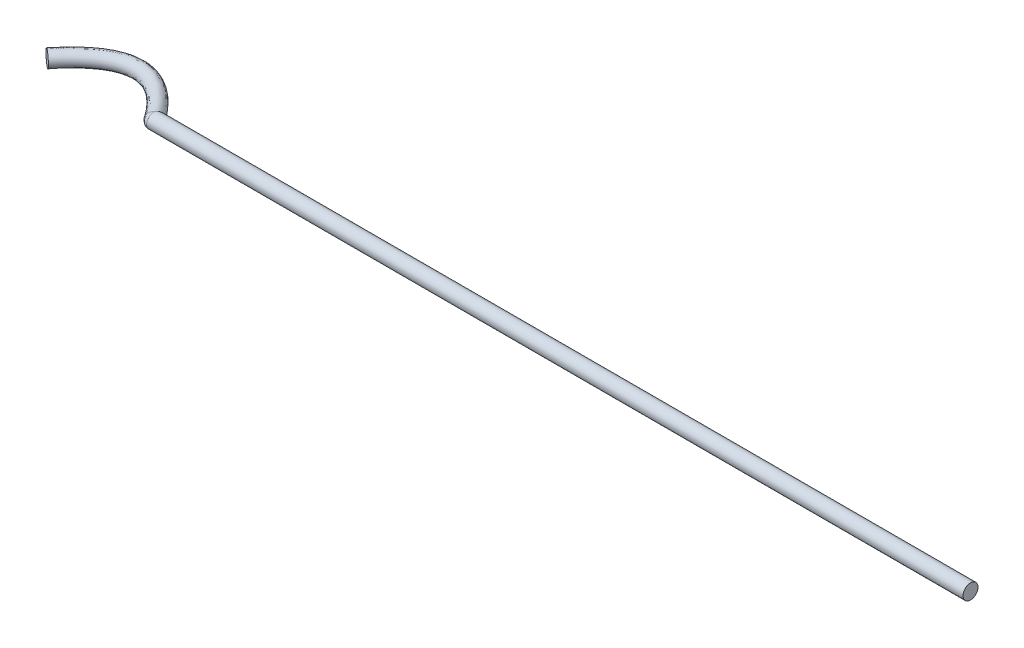
ISO-10303-21;
HEADER;
FILE_DESCRIPTION(('STEP AP214'),'2;1');
FILE_NAME('part.step','',(''),(''),'','','');
FILE_SCHEMA(('AUTOMOTIVE_DESIGN { 1 0 10303 214 1 1 1 1 }'));
ENDSEC;
DATA;
#1=APPLICATION_CONTEXT('core data for automotive mechanical design processes');
#2=APPLICATION_PROTOCOL_DEFINITION('international standard','automotive_design',2000,#1);
#3=PRODUCT_CONTEXT('',#1,'mechanical');
#4=PRODUCT('Part','Part','',(#3));
#5=PRODUCT_RELATED_PRODUCT_CATEGORY('part','',(#4));
#6=PRODUCT_DEFINITION_FORMATION('','',#4);
#7=PRODUCT_DEFINITION_CONTEXT('part definition',#1,'design');
#8=PRODUCT_DEFINITION('design','',#6,#7);
#9=PRODUCT_DEFINITION_SHAPE('','',#8);
#10=(LENGTH_UNIT() NAMED_UNIT(*) SI_UNIT(.MILLI.,.METRE.));
#11=(NAMED_UNIT(*) PLANE_ANGLE_UNIT() SI_UNIT($,.RADIAN.));
#12=(NAMED_UNIT(*) SI_UNIT($,.STERADIAN.) SOLID_ANGLE_UNIT());
#13=UNCERTAINTY_MEASURE_WITH_UNIT(LENGTH_MEASURE(1.E-05),#10,'distance_accuracy_value','');
#14=(GEOMETRIC_REPRESENTATION_CONTEXT(3) GLOBAL_UNCERTAINTY_ASSIGNED_CONTEXT((#13)) GLOBAL_UNIT_ASSIGNED_CONTEXT((#10,
#11,#12)) REPRESENTATION_CONTEXT('',''));
#15=CARTESIAN_POINT('',(0.,0.,0.));
#16=DIRECTION('',(0.,0.,1.));
#17=DIRECTION('',(1.,0.,0.));
#18=AXIS2_PLACEMENT_3D('',#15,#16,#17);
#19=CARTESIAN_POINT('',(142.755413202627,0.,1.05970796374089E-08));
#20=DIRECTION('',(1.,0.,0.));
#21=DIRECTION('',(0.,0.,-1.));
#22=AXIS2_PLACEMENT_3D('',#19,#20,#21);
#23=PLANE('',#22);
#24=CARTESIAN_POINT('',(142.755413202627,0.,1.05970796374089E-08));
#25=DIRECTION('',(1.,0.,0.));
#26=DIRECTION('',(0.,0.,-1.));
#27=AXIS2_PLACEMENT_3D('',#24,#25,#26);
#28=CIRCLE('',#27,1.);
#29=CARTESIAN_POINT('',(142.755413202627,0.,-0.99999998940292));
#30=VERTEX_POINT('',#29);
#31=EDGE_CURVE('E74',#30,#30,#28,.T.);
#32=ORIENTED_EDGE('',*,*,#31,.T.);
#33=EDGE_LOOP('',(#32));
#34=FACE_BOUND('',#33,.T.);
#35=ADVANCED_FACE('F35',(#34),#23,.T.);
#36=CARTESIAN_POINT('',(19.2045723780013,0.,0.));
#37=DIRECTION('',(0.623586463221528,0.,-0.781754387827063));
#38=DIRECTION('',(-0.781754387827063,0.,-0.623586463221528));
#39=AXIS2_PLACEMENT_3D('',#36,#37,#38);
#40=PLANE('',#39);
#41=CARTESIAN_POINT('',(19.2045723780013,0.,0.));
#42=DIRECTION('',(0.623586463221528,0.,-0.781754387827063));
#43=DIRECTION('',(-0.781754387827063,0.,-0.623586463221528));
#44=AXIS2_PLACEMENT_3D('',#41,#42,#43);
#45=CIRCLE('',#44,1.);
#46=CARTESIAN_POINT('',(18.4228179901742,0.,-0.623586463221501));
#47=VERTEX_POINT('',#46);
#48=EDGE_CURVE('E64',#47,#47,#45,.T.);
#49=ORIENTED_EDGE('',*,*,#48,.F.);
#50=EDGE_LOOP('',(#49));
#51=FACE_BOUND('',#50,.T.);
#52=ADVANCED_FACE('F96',(#51),#40,.F.);
#53=CARTESIAN_POINT('',(32.8922100901938,0.,1.05970796374089E-08));
#54=DIRECTION('',(1.,0.,0.));
#55=DIRECTION('',(0.,0.,-1.));
#56=AXIS2_PLACEMENT_3D('',#53,#54,#55);
#57=CYLINDRICAL_SURFACE('',#56,1.);
#58=CARTESIAN_POINT('',(33.5634876384177,-1.,1.05970794849486E-08));
#59=CARTESIAN_POINT('',(33.5645618571712,-1.00000001707824,-0.00206843211272683));
#60=CARTESIAN_POINT('',(33.565636073607,-0.999993598383162,-0.00413704757754758));
#61=CARTESIAN_POINT('',(33.5986736436733,-0.999598246638996,-0.0677628444332316));
#62=CARTESIAN_POINT('',(33.6306179253825,-0.993517402724324,-0.129439853689024));
#63=CARTESIAN_POINT('',(33.6935439684631,-0.969918293114115,-0.251244158086531));
#64=CARTESIAN_POINT('',(33.7245227170214,-0.952367378941007,-0.311366518689833));
#65=CARTESIAN_POINT('',(33.7846063846737,-0.905844840684269,-0.42825995213969));
#66=CARTESIAN_POINT('',(33.8137072235116,-0.876849261828727,-0.485023706680189));
#67=CARTESIAN_POINT('',(33.8689192108485,-0.807771463073951,-0.592961904271321));
#68=CARTESIAN_POINT('',(33.8950332772621,-0.767700196604047,-0.644141800156));
#69=CARTESIAN_POINT('',(33.941448845235,-0.680472351006147,-0.73528507147826));
#70=CARTESIAN_POINT('',(33.9620340567545,-0.634037297478791,-0.775791807949197));
#71=CARTESIAN_POINT('',(33.998765685496,-0.533325377361822,-0.84817381113771));
#72=CARTESIAN_POINT('',(34.0149157564868,-0.479055022253214,-0.880056182475265));
#73=CARTESIAN_POINT('',(34.0403248121784,-0.37111475846728,-0.930265600920773));
#74=CARTESIAN_POINT('',(34.0501686729454,-0.3181163286775,-0.949741590321047));
#75=CARTESIAN_POINT('',(34.065227329107,-0.208987567106348,-0.979548800169467));
#76=CARTESIAN_POINT('',(34.0704454651527,-0.152859526686506,-0.989886620094845));
#77=CARTESIAN_POINT('',(34.0757201076478,-0.0447205214606043,-1.00033682367351));
#78=CARTESIAN_POINT('',(34.0762114786276,0.00718793330168519,-1.0013106910395));
#79=CARTESIAN_POINT('',(34.0731422322687,0.110403508472085,-0.995229358400241));
#80=CARTESIAN_POINT('',(34.0695824983274,0.161710757516657,-0.988175908858395));
#81=CARTESIAN_POINT('',(34.0587213809389,0.260878590586203,-0.966669333665237));
#82=CARTESIAN_POINT('',(34.0515218512398,0.308794517637005,-0.952417648703762));
#83=CARTESIAN_POINT('',(34.0337299049864,0.401426725887555,-0.917230902854717));
#84=CARTESIAN_POINT('',(34.0231369694115,0.44614251634633,-0.896294819591532));
#85=CARTESIAN_POINT('',(33.9984186127761,0.533237999151212,-0.847499369345232));
#86=CARTESIAN_POINT('',(33.9841607762834,0.575434312322461,-0.819380807001654));
#87=CARTESIAN_POINT('',(33.9528573500051,0.654483346586658,-0.757737605279711));
#88=CARTESIAN_POINT('',(33.9358112598222,0.691335106269149,-0.724211995534314));
#89=CARTESIAN_POINT('',(33.8977655023653,0.762249045884659,-0.649510320244149));
#90=CARTESIAN_POINT('',(33.8765472382783,0.795752427981589,-0.607915725242693));
#91=CARTESIAN_POINT('',(33.8319768566358,0.855364302023736,-0.520717743084864));
#92=CARTESIAN_POINT('',(33.8086222681337,0.881464083951692,-0.475109716230344));
#93=CARTESIAN_POINT('',(33.7553267883935,0.930659629166448,-0.371250222256335));
#94=CARTESIAN_POINT('',(33.7250280501394,0.951993907192843,-0.312345525250553));
#95=CARTESIAN_POINT('',(33.6631511402496,0.983275848501732,-0.192363271745083));
#96=CARTESIAN_POINT('',(33.6315753798832,0.993244020993211,-0.131289834628256));
#97=CARTESIAN_POINT('',(33.5887965811424,0.999038227252166,-0.0487594090821208));
#98=CARTESIAN_POINT('',(33.5777581085035,0.999848761517422,-0.0274823865216696));
#99=CARTESIAN_POINT('',(33.5656361429811,0.999993575747745,-0.00413718371064076));
#100=CARTESIAN_POINT('',(33.5645619289377,0.999999993574401,-0.00206857299587797));
#101=CARTESIAN_POINT('',(33.5634876384177,1.,1.05970794849486E-08));
#102=B_SPLINE_CURVE_WITH_KNOTS('',3,(#58,#59,#60,#61,#62,#63,#64,#65,#66,#67,#68,#69,#70,#71,
#72,#73,#74,#75,#76,#77,#78,#79,#80,#81,#82,#83,#84,#85,#86,#87,#88,#89,#90,#91,#92,#93,#94,#95,
#96,#97,#98,#99,#100,#101),.UNSPECIFIED.,.F.,.F.,(4,2,2,2,2,2,2,2,2,2,2,2,2,2,2,2,2,2,2,2,2,4),
(0.,0.0069926949216396,0.215064933442348,0.423732024814681,0.632838212303739,0.841738337208042,
1.03553833475279,1.22917819324666,1.40018101455756,1.57106023853186,1.72604913651374,
1.88100424357622,2.03184514714453,2.18270913282006,2.34006630740664,2.49745175333244,
2.66915557307549,2.84106056504955,3.04881432184063,3.25619260774662,3.32811546508498,
3.33510816000663),.UNSPECIFIED.);
#103=CARTESIAN_POINT('',(33.5634876384177,-1.,1.05970794849486E-08));
#104=VERTEX_POINT('',#103);
#105=CARTESIAN_POINT('',(33.5634876384177,1.,1.05970794849486E-08));
#106=VERTEX_POINT('',#105);
#107=EDGE_CURVE('E60',#104,#106,#102,.T.);
#108=ORIENTED_EDGE('',*,*,#107,.T.);
#109=CARTESIAN_POINT('',(33.5634876384163,1.,1.0599347923879E-08));
#110=CARTESIAN_POINT('',(33.563487638417,1.,1.05982130183477E-08));
#111=CARTESIAN_POINT('',(33.5634876384177,1.,1.05970781128164E-08));
#112=CARTESIAN_POINT('',(33.5583326452643,1.00000017527205,0.00403970542274364));
#113=CARTESIAN_POINT('',(33.560740318687,0.999999720157798,0.00529006858815662));
#114=CARTESIAN_POINT('',(33.5631479681356,1.00000017527251,0.00654047791995372));
#115=CARTESIAN_POINT('',(33.5531766296348,0.99993597797552,0.0080802009670581));
#116=CARTESIAN_POINT('',(33.5579923657262,0.999960141903188,0.0105813454637634));
#117=CARTESIAN_POINT('',(33.5628082304812,0.999935977975861,0.013082242217189));
#118=CARTESIAN_POINT('',(33.4993852061216,0.998594878029329,0.050233676407915));
#119=CARTESIAN_POINT('',(33.5293115482904,0.999134732013883,0.0658072304092581));
#120=CARTESIAN_POINT('',(33.559263832375,0.998594878015358,0.081330832347194));
#121=CARTESIAN_POINT('',(33.4507398682004,0.991656715418915,0.0883543908193207));
#122=CARTESIAN_POINT('',(33.5032634472072,0.994863916455852,0.115963693521937));
#123=CARTESIAN_POINT('',(33.5560585176457,0.991656715279997,0.143050230171953));
#124=CARTESIAN_POINT('',(33.3549044405813,0.966349053285513,0.163455331235492));
#125=CARTESIAN_POINT('',(33.4509845621792,0.978792201549973,0.216628310077008));
#126=CARTESIAN_POINT('',(33.5497437767522,0.966349051510766,0.264642609212375));
#127=CARTESIAN_POINT('',(33.3077159688607,0.947967292345187,0.200434289223319));
#128=CARTESIAN_POINT('',(33.4246299612976,0.96690517465437,0.267374876418478));
#129=CARTESIAN_POINT('',(33.5466344571989,0.947967289058071,0.324513537542976));
#130=CARTESIAN_POINT('',(33.2160309999586,0.899797374814006,0.27228257735366));
#131=CARTESIAN_POINT('',(33.3715529191412,0.934090796110148,0.36957623222255));
#132=CARTESIAN_POINT('',(33.5405931964196,0.899797366294538,0.440839873670975));
#133=CARTESIAN_POINT('',(33.171545929159,0.86996424103204,0.307142952970489));
#134=CARTESIAN_POINT('',(33.3447196103025,0.912972199576392,0.42124449944437));
#135=CARTESIAN_POINT('',(33.5376620080955,0.869964228783853,0.497280783928699));
#136=CARTESIAN_POINT('',(33.0871996900747,0.799325708638596,0.373240155932504));
#137=CARTESIAN_POINT('',(33.2912469455894,0.859442040816378,0.524207517513955));
#138=CARTESIAN_POINT('',(33.5321043075086,0.799325688022374,0.604295938659696));
#139=CARTESIAN_POINT('',(33.0473250756087,0.758553430928407,0.404487520461767));
#140=CARTESIAN_POINT('',(33.2645320813386,0.826834234105904,0.575647661144126));
#141=CARTESIAN_POINT('',(33.5294769092562,0.758553405675631,0.654887243238981));
#142=CARTESIAN_POINT('',(32.9764234718248,0.670002895720354,0.460048847878707));
#143=CARTESIAN_POINT('',(33.2142707604962,0.750456866455089,0.67242706034935));
#144=CARTESIAN_POINT('',(33.5248050962309,0.670002862610851,0.744844312985016));
#145=CARTESIAN_POINT('',(32.9449697215301,0.622925942306552,0.484697241078829));
#146=CARTESIAN_POINT('',(33.1906061650005,0.707390618848897,0.71799379757729));
#147=CARTESIAN_POINT('',(33.5227325615244,0.622925905899787,0.784751537345482));
#148=CARTESIAN_POINT('',(32.8889685710638,0.521005661914969,0.528581915747774));
#149=CARTESIAN_POINT('',(33.146218792874,0.607508424356457,0.803462707246637));
#150=CARTESIAN_POINT('',(33.5190425620126,0.521005622180927,0.855803475640208));
#151=CARTESIAN_POINT('',(32.8644140336748,0.466170449817818,0.547823790246045));
#152=CARTESIAN_POINT('',(33.125565343926,0.550571809202559,0.843231387299727));
#153=CARTESIAN_POINT('',(33.5174246269254,0.466170410050373,0.886957245000646));
#154=CARTESIAN_POINT('',(32.8267166958155,0.35926388010532,0.577364854908452));
#155=CARTESIAN_POINT('',(33.0925201777565,0.433144480352106,0.906860586850707));
#156=CARTESIAN_POINT('',(33.5149406931933,0.359263844074003,0.934786041458632));
#157=CARTESIAN_POINT('',(32.8124095851906,0.308028959647363,0.58857644468085));
#158=CARTESIAN_POINT('',(33.0794161042199,0.374451132341706,0.932092765935491));
#159=CARTESIAN_POINT('',(33.5139979764042,0.308028926811141,0.952938297772015));
#160=CARTESIAN_POINT('',(32.7904912534921,0.202715571262597,0.605752470522789));
#161=CARTESIAN_POINT('',(33.0588714338136,0.249739310019017,0.971651973543824));
#162=CARTESIAN_POINT('',(33.5125537449709,0.202715547579491,0.980747346915997));
#163=CARTESIAN_POINT('',(32.7828752923419,0.148639145114601,0.611720621096671));
#164=CARTESIAN_POINT('',(33.051508470796,0.183923070803632,0.985829516381074));
#165=CARTESIAN_POINT('',(33.512051917996,0.148639127387555,0.99041015375681));
#166=CARTESIAN_POINT('',(32.7750412394666,0.0434317615714261,0.6178596763614));
#167=CARTESIAN_POINT('',(33.0438864151151,0.0540540284430793,1.00050594759188));
#168=CARTESIAN_POINT('',(33.5115357206342,0.0434317562272698,1.00034966601376));
#169=CARTESIAN_POINT('',(32.7743208280073,-0.00762377671425389,0.61842421749655));
#170=CARTESIAN_POINT('',(33.0431763661558,-0.00952452543752111,1.00187316196964));
#171=CARTESIAN_POINT('',(33.5114882516551,-0.00762377569829967,1.0012636933));
#172=CARTESIAN_POINT('',(32.7790022139256,-0.109154089371847,0.614755709440504));
#173=CARTESIAN_POINT('',(33.0477477238517,-0.135377011758896,0.993070915063814));
#174=CARTESIAN_POINT('',(33.5117967151153,-0.109154076175719,0.995324150531231));
#175=CARTESIAN_POINT('',(32.7844034525975,-0.159628916318967,0.610523098071874));
#176=CARTESIAN_POINT('',(33.0530094854984,-0.197390129558612,0.982939280663443));
#177=CARTESIAN_POINT('',(33.5121526107408,-0.159628897302725,0.988471289338209));
#178=CARTESIAN_POINT('',(32.8010538496347,-0.258436826311597,0.597475224848372));
#179=CARTESIAN_POINT('',(33.0688390537305,-0.316265521842121,0.952459105955179));
#180=CARTESIAN_POINT('',(33.5132497301191,-0.258436797575616,0.96734597341924));
#181=CARTESIAN_POINT('',(32.8122902514871,-0.306774332714654,0.58866995947828));
#182=CARTESIAN_POINT('',(33.0793374052037,-0.372949077040057,0.932244302977881));
#183=CARTESIAN_POINT('',(33.5139901133264,-0.306774300074893,0.953089703618175));
#184=CARTESIAN_POINT('',(32.8401277329115,-0.4002487267014,0.566855458293986));
#185=CARTESIAN_POINT('',(33.1044333567383,-0.478896267597812,0.883921497784031));
#186=CARTESIAN_POINT('',(33.5158243663888,-0.400248688783991,0.917770682558624));
#187=CARTESIAN_POINT('',(32.8567372172254,-0.445380463942184,0.553839636196544));
#188=CARTESIAN_POINT('',(33.1189686566204,-0.528069854447588,0.855933455972328));
#189=CARTESIAN_POINT('',(33.5169187900449,-0.445380424654893,0.896697267710754));
#190=CARTESIAN_POINT('',(32.8952291840759,-0.532638564415938,0.523675855898953));
#191=CARTESIAN_POINT('',(33.1512218578494,-0.619147824537299,0.79382918974049));
#192=CARTESIAN_POINT('',(33.5194550831631,-0.532638524878462,0.847860269053471));
#193=CARTESIAN_POINT('',(32.9172517883959,-0.574638280040118,0.50641809252461));
#194=CARTESIAN_POINT('',(33.1689679385769,-0.660833019763568,0.759658705072188));
#195=CARTESIAN_POINT('',(33.520906185461,-0.574638241696389,0.81991890430827));
#196=CARTESIAN_POINT('',(32.9655222451827,-0.653384719975428,0.468591475523054));
#197=CARTESIAN_POINT('',(33.2060656831409,-0.735316375295904,0.68822612938919));
#198=CARTESIAN_POINT('',(33.5240867980869,-0.653384685702211,0.758675340005979));
#199=CARTESIAN_POINT('',(32.9917767887296,-0.690122948758282,0.44801737847095));
#200=CARTESIAN_POINT('',(33.2253931104493,-0.768188645346138,0.651010706564431));
#201=CARTESIAN_POINT('',(33.5258167493004,-0.690122917364514,0.725364651059709));
#202=CARTESIAN_POINT('',(33.0810411628006,-0.798003838682993,0.378066240964416));
#203=CARTESIAN_POINT('',(33.2876305479194,-0.859626018852598,0.531170993901763));
#204=CARTESIAN_POINT('',(33.5316985128526,-0.798003817277604,0.612109638635763));
#205=CARTESIAN_POINT('',(33.150682801895,-0.858211460108621,0.32349219509103));
#206=CARTESIAN_POINT('',(33.332262134845,-0.904539644330012,0.445231720233561));
#207=CARTESIAN_POINT('',(33.5362873052242,-0.858211446775006,0.523751109465869));
#208=CARTESIAN_POINT('',(33.3073182572667,-0.952791298080286,0.20074598264367));
#209=CARTESIAN_POINT('',(33.4248893738353,-0.970670157300568,0.266875394418477));
#210=CARTESIAN_POINT('',(33.5466082513368,-0.9527912955414,0.32501815643727));
#211=CARTESIAN_POINT('',(33.3953818854532,-0.983515763116975,0.131735440388595));
#212=CARTESIAN_POINT('',(33.473428815746,-0.989778525205945,0.173411242816727));
#213=CARTESIAN_POINT('',(33.5524108966286,-0.983515762600918,0.213286381671401));
#214=CARTESIAN_POINT('',(33.5054218018745,-0.997653842088145,0.0455031087878745));
#215=CARTESIAN_POINT('',(33.5325203098151,-0.998542262348482,0.0596286443973174));
#216=CARTESIAN_POINT('',(33.5596615927971,-0.997653842083429,0.0736718152746343));
#217=CARTESIAN_POINT('',(33.5267122350289,-0.999277656884468,0.0288189384952626));
#218=CARTESIAN_POINT('',(33.5438841691981,-0.999552309962828,0.0377471554894));
#219=CARTESIAN_POINT('',(33.5610644515743,-0.999277656886274,0.0466592977374858));
#220=CARTESIAN_POINT('',(33.5531752823525,-0.999935587438923,0.00808125676964304));
#221=CARTESIAN_POINT('',(33.5579916052308,-0.999960557789523,0.0105828097995959));
#222=CARTESIAN_POINT('',(33.5628081417099,-0.999935587439514,0.0130839515313309));
#223=CARTESIAN_POINT('',(33.5583311072671,-0.999999720458585,0.0040409106687492));
#224=CARTESIAN_POINT('',(33.5607394481972,-1.0000002306226,0.0052917447262729));
#225=CARTESIAN_POINT('',(33.5631478667967,-0.9999997204585,0.00654242922601521));
#226=CARTESIAN_POINT('',(33.5634876384043,-1.,1.06134015692792E-08));
#227=CARTESIAN_POINT('',(33.563487638411,-1.,1.06052398410427E-08));
#228=CARTESIAN_POINT('',(33.5634876384177,-1.,1.05970781128062E-08));
#229=(BOUNDED_SURFACE() B_SPLINE_SURFACE(3,2,((#109,#110,#111),(#112,#113,#114),(#115,#116,
#117),(#118,#119,#120),(#121,#122,#123),(#124,#125,#126),(#127,#128,#129),(#130,#131,#132),
(#133,#134,#135),(#136,#137,#138),(#139,#140,#141),(#142,#143,#144),(#145,#146,#147),(#148,#149,
#150),(#151,#152,#153),(#154,#155,#156),(#157,#158,#159),(#160,#161,#162),(#163,#164,#165),
(#166,#167,#168),(#169,#170,#171),(#172,#173,#174),(#175,#176,#177),(#178,#179,#180),(#181,#182,
#183),(#184,#185,#186),(#187,#188,#189),(#190,#191,#192),(#193,#194,#195),(#196,#197,#198),
(#199,#200,#201),(#202,#203,#204),(#205,#206,#207),(#208,#209,#210),(#211,#212,#213),(#214,#215,
#216),(#217,#218,#219),(#220,#221,#222),(#223,#224,#225),(#226,#227,#228)),.UNSPECIFIED.,.F.,
.F.,.F.) B_SPLINE_SURFACE_WITH_KNOTS((4,2,2,2,2,2,2,2,2,2,2,2,2,2,2,2,2,2,2,4),(3,3),(0.,
0.00221135975834844,0.0230700590877943,0.0439511463442617,0.0649151009450075,0.0858162847372265,
0.105236186574584,0.124635923979986,0.141101410418374,0.157555223115761,0.172800415242591,
0.188044216095807,0.203254831211352,0.218489355232701,0.234169832799107,0.249875350297204,
0.284226312954623,0.322423658930579,0.331564733870084,0.333776093628432),(0.,1.),
.UNSPECIFIED.) GEOMETRIC_REPRESENTATION_ITEM() RATIONAL_B_SPLINE_SURFACE(((1.,1.,1.),(1.,
1.00000015317631,1.),(1.,0.999986494475104,1.),(1.,0.999700671783427,1.),(1.,0.99821989135975,
1.),(1.,0.992933819967693,1.),(1.,0.989126035776246,1.),(1.,0.979521223065697,1.),(1.,
0.97371636012893,1.),(1.,0.960769359275711,1.),(1.,0.953631277505015,1.),(1.,0.939466544444144,
1.),(1.,0.932467848146358,1.),(1.,0.919095987276323,1.),(1.,0.912722180736016,1.),(1.,
0.902500881477163,1.),(1.,0.898417093322185,1.),(1.,0.892038551286664,1.),(1.,0.889742531064951,
1.),(1.,0.887376629262475,1.),(1.,0.887155614498465,1.),(1.,0.88857413394442,1.),(1.,
0.890213498362846,1.),(1.,0.895128493505031,1.),(1.,0.898400554309364,1.),(1.,0.906178221943761,
1.),(1.,0.9106857596469,1.),(1.,0.92057169133087,1.),(1.,0.925971715074011,1.),(1.,
0.936998557045195,1.),(1.,0.942625723667827,1.),(1.,0.960112144719853,1.),(1.,0.971439024375837,
1.),(1.,0.989936590385214,1.),(1.,0.996499878844236,1.),(1.,0.99950396058657,1.),(1.,
0.999846992364841,1.),(1.,0.99998621699724,1.),(1.,0.999999822330879,1.),(1.,1.,1.))) REPRESENTATION_ITEM('') SURFACE());
#230=CARTESIAN_POINT('',(33.5634876384177,1.,1.05970781128164E-08));
#231=CARTESIAN_POINT('',(33.5631479681356,1.00000017527251,0.00654047791995372));
#232=CARTESIAN_POINT('',(33.5628082304812,0.999935977975861,0.013082242217189));
#233=CARTESIAN_POINT('',(33.559263832375,0.998594878015358,0.081330832347194));
#234=CARTESIAN_POINT('',(33.5560585176457,0.991656715279997,0.143050230171953));
#235=CARTESIAN_POINT('',(33.5497437767522,0.966349051510766,0.264642609212375));
#236=CARTESIAN_POINT('',(33.5466344571989,0.947967289058071,0.324513537542976));
#237=CARTESIAN_POINT('',(33.5405931964196,0.899797366294538,0.440839873670975));
#238=CARTESIAN_POINT('',(33.5376620080955,0.869964228783853,0.497280783928699));
#239=CARTESIAN_POINT('',(33.5321043075086,0.799325688022374,0.604295938659696));
#240=CARTESIAN_POINT('',(33.5294769092562,0.758553405675631,0.654887243238981));
#241=CARTESIAN_POINT('',(33.5248050962309,0.670002862610852,0.744844312985016));
#242=CARTESIAN_POINT('',(33.5227325615244,0.622925905899787,0.784751537345482));
#243=CARTESIAN_POINT('',(33.5190425620126,0.521005622180927,0.855803475640208));
#244=CARTESIAN_POINT('',(33.5174246269254,0.466170410050373,0.886957245000646));
#245=CARTESIAN_POINT('',(33.5149406931933,0.359263844074003,0.934786041458632));
#246=CARTESIAN_POINT('',(33.5139979764042,0.308028926811141,0.952938297772015));
#247=CARTESIAN_POINT('',(33.5125537449709,0.202715547579491,0.980747346915997));
#248=CARTESIAN_POINT('',(33.512051917996,0.148639127387555,0.99041015375681));
#249=CARTESIAN_POINT('',(33.5115357206342,0.0434317562272698,1.00034966601376));
#250=CARTESIAN_POINT('',(33.5114882516551,-0.00762377569829962,1.0012636933));
#251=CARTESIAN_POINT('',(33.5117967151153,-0.109154076175719,0.995324150531231));
#252=CARTESIAN_POINT('',(33.5121526107408,-0.159628897302725,0.988471289338209));
#253=CARTESIAN_POINT('',(33.5132497301191,-0.258436797575616,0.96734597341924));
#254=CARTESIAN_POINT('',(33.5139901133264,-0.306774300074893,0.953089703618175));
#255=CARTESIAN_POINT('',(33.5158243663888,-0.400248688783991,0.917770682558624));
#256=CARTESIAN_POINT('',(33.5169187900449,-0.445380424654893,0.896697267710754));
#257=CARTESIAN_POINT('',(33.5194550831631,-0.532638524878462,0.847860269053471));
#258=CARTESIAN_POINT('',(33.520906185461,-0.574638241696389,0.81991890430827));
#259=CARTESIAN_POINT('',(33.5240867980869,-0.653384685702211,0.758675340005979));
#260=CARTESIAN_POINT('',(33.5258167493004,-0.690122917364514,0.72536465105971));
#261=CARTESIAN_POINT('',(33.5316985128526,-0.798003817277604,0.612109638635763));
#262=CARTESIAN_POINT('',(33.5362873052242,-0.858211446775006,0.523751109465869));
#263=CARTESIAN_POINT('',(33.5466082513368,-0.9527912955414,0.32501815643727));
#264=CARTESIAN_POINT('',(33.5524108966286,-0.983515762600918,0.2132863816714));
#265=CARTESIAN_POINT('',(33.5596615927971,-0.997653842083429,0.0736718152746344));
#266=CARTESIAN_POINT('',(33.5610644515743,-0.999277656886274,0.0466592977374858));
#267=CARTESIAN_POINT('',(33.5628081417099,-0.999935587439514,0.0130839515313309));
#268=CARTESIAN_POINT('',(33.5631478667967,-0.9999997204585,0.00654242922601521));
#269=CARTESIAN_POINT('',(33.5634876384177,-1.,1.05970781128062E-08));
#270=B_SPLINE_CURVE_WITH_KNOTS('',3,(#230,#231,#232,#233,#234,#235,#236,#237,#238,#239,#240,
#241,#242,#243,#244,#245,#246,#247,#248,#249,#250,#251,#252,#253,#254,#255,#256,#257,#258,#259,
#260,#261,#262,#263,#264,#265,#266,#267,#268,#269),.UNSPECIFIED.,.F.,.F.,(4,2,2,2,2,2,2,2,2,2,2,
2,2,2,2,2,2,2,2,4),(0.,0.00221135975834844,0.0230700590877943,0.0439511463442617,
0.0649151009450075,0.0858162847372265,0.105236186574584,0.124635923979986,0.141101410418374,
0.157555223115761,0.172800415242591,0.188044216095807,0.203254831211352,0.218489355232701,
0.234169832799107,0.249875350297204,0.284226312954623,0.322423658930579,0.331564733870084,
0.333776093628432),.UNSPECIFIED.);
#271=EDGE_CURVE('E11',#106,#104,#270,.T.);
#272=ORIENTED_EDGE('',*,*,#271,.T.);
#273=EDGE_LOOP('',(#108,#272));
#274=FACE_BOUND('',#273,.T.);
#275=ORIENTED_EDGE('',*,*,#31,.F.);
#276=EDGE_LOOP('',(#275));
#277=FACE_BOUND('',#276,.T.);
#278=ADVANCED_FACE('F58',(#274,#277),#57,.T.);
#279=CARTESIAN_POINT('',(18.4228179901742,0.,-0.623586463221512));
#280=CARTESIAN_POINT('',(19.7424759047375,0.,-2.27796548901796));
#281=CARTESIAN_POINT('',(21.0633845920573,0.,-3.55066802562976));
#282=CARTESIAN_POINT('',(23.7793936991134,0.,-5.30513360359097));
#283=CARTESIAN_POINT('',(25.1916045285417,0.,-5.78388598504048));
#284=CARTESIAN_POINT('',(28.0289768773406,0.,-5.7838859822206));
#285=CARTESIAN_POINT('',(29.4189943963167,0.,-5.3001728145426));
#286=CARTESIAN_POINT('',(31.3559075107278,0.,-3.9675524977962));
#287=CARTESIAN_POINT('',(31.9812577470505,0.,-3.42306549331803));
#288=CARTESIAN_POINT('',(33.2016437046519,0.,-2.14277372826812));
#289=CARTESIAN_POINT('',(33.808919214756,0.,-1.3895676171292));
#290=CARTESIAN_POINT('',(34.5129920840388,0.,-0.38818280785756));
#291=CARTESIAN_POINT('',(34.6389248562382,0.,-0.209063324237339));
#292=CARTESIAN_POINT('',(34.7676207713032,0.,-0.0260181568419726));
#293=CARTESIAN_POINT('',(18.4228179901742,2.,-0.623586463221512));
#294=CARTESIAN_POINT('',(19.7424759047375,2.,-2.27796548901796));
#295=CARTESIAN_POINT('',(21.0633845920573,2.,-3.55066802562976));
#296=CARTESIAN_POINT('',(23.7793936991134,2.,-5.30513360359097));
#297=CARTESIAN_POINT('',(25.1916045285417,2.,-5.78388598504048));
#298=CARTESIAN_POINT('',(28.0289768773406,2.,-5.7838859822206));
#299=CARTESIAN_POINT('',(29.4189943963167,2.,-5.3001728145426));
#300=CARTESIAN_POINT('',(31.3559075107278,2.,-3.9675524977962));
#301=CARTESIAN_POINT('',(31.9812577470505,2.,-3.42306549331803));
#302=CARTESIAN_POINT('',(33.2016437046519,2.,-2.14277372826812));
#303=CARTESIAN_POINT('',(33.808919214756,2.,-1.3895676171292));
#304=CARTESIAN_POINT('',(34.5129920840388,2.,-0.38818280785756));
#305=CARTESIAN_POINT('',(34.6389248562382,2.,-0.209063324237339));
#306=CARTESIAN_POINT('',(34.7676207713032,2.,-0.0260181568419726));
#307=CARTESIAN_POINT('',(19.9863267658283,2.,0.623586463221554));
#308=CARTESIAN_POINT('',(21.2106618572105,2.,-0.911291835343395));
#309=CARTESIAN_POINT('',(22.3960360604223,2.,-2.03053229127319));
#310=CARTESIAN_POINT('',(24.6171725028095,2.,-3.4653240356962));
#311=CARTESIAN_POINT('',(25.6358243324594,2.,-3.7838859839886));
#312=CARTESIAN_POINT('',(27.5847570704709,2.,-3.78388598327247));
#313=CARTESIAN_POINT('',(28.5501819792356,2.,-3.47028481768806));
#314=CARTESIAN_POINT('',(30.0898673329226,2.,-2.41096213733554));
#315=CARTESIAN_POINT('',(30.6139557237283,2.,-1.95880622657524));
#316=CARTESIAN_POINT('',(31.6735919625208,2.,-0.847154995374793));
#317=CARTESIAN_POINT('',(32.1968984096056,2.,-0.205026940332796));
#318=CARTESIAN_POINT('',(32.8713753930297,2.,0.75426533865635));
#319=CARTESIAN_POINT('',(33.00283408086,2.,0.941244015008352));
#320=CARTESIAN_POINT('',(33.131529995925,2.,1.12428918240372));
#321=CARTESIAN_POINT('',(19.9863267658283,0.,0.623586463221554));
#322=CARTESIAN_POINT('',(21.2106618572105,0.,-0.911291835343395));
#323=CARTESIAN_POINT('',(22.3960360604223,0.,-2.03053229127319));
#324=CARTESIAN_POINT('',(24.6171725028095,0.,-3.4653240356962));
#325=CARTESIAN_POINT('',(25.6358243324594,0.,-3.78388598398834));
#326=CARTESIAN_POINT('',(27.5847570704709,0.,-3.78388598327273));
#327=CARTESIAN_POINT('',(28.5501819792356,0.,-3.47028481768806));
#328=CARTESIAN_POINT('',(30.0898673329226,0.,-2.41096213733554));
#329=CARTESIAN_POINT('',(30.6139557237283,0.,-1.95880622657524));
#330=CARTESIAN_POINT('',(31.6735919625208,0.,-0.847154995374793));
#331=CARTESIAN_POINT('',(32.1968984096056,0.,-0.205026940332796));
#332=CARTESIAN_POINT('',(32.8713753930297,0.,0.75426533865635));
#333=CARTESIAN_POINT('',(33.00283408086,0.,0.941244015008352));
#334=CARTESIAN_POINT('',(33.131529995925,0.,1.12428918240372));
#335=CARTESIAN_POINT('',(19.9863267658283,-2.,0.623586463221554));
#336=CARTESIAN_POINT('',(21.2106618572105,-2.,-0.911291835343395));
#337=CARTESIAN_POINT('',(22.3960360604223,-2.,-2.03053229127319));
#338=CARTESIAN_POINT('',(24.6171725028095,-2.,-3.4653240356962));
#339=CARTESIAN_POINT('',(25.6358243324594,-2.,-3.78388598398808));
#340=CARTESIAN_POINT('',(27.5847570704709,-2.,-3.78388598327299));
#341=CARTESIAN_POINT('',(28.5501819792356,-2.,-3.47028481768806));
#342=CARTESIAN_POINT('',(30.0898673329226,-2.,-2.41096213733554));
#343=CARTESIAN_POINT('',(30.6139557237283,-2.,-1.95880622657524));
#344=CARTESIAN_POINT('',(31.6735919625208,-2.,-0.847154995374793));
#345=CARTESIAN_POINT('',(32.1968984096056,-2.,-0.205026940332796));
#346=CARTESIAN_POINT('',(32.8713753930297,-2.,0.75426533865635));
#347=CARTESIAN_POINT('',(33.00283408086,-2.,0.941244015008352));
#348=CARTESIAN_POINT('',(33.131529995925,-2.,1.12428918240372));
#349=CARTESIAN_POINT('',(18.4228179901742,-2.,-0.623586463221512));
#350=CARTESIAN_POINT('',(19.7424759047375,-2.,-2.27796548901796));
#351=CARTESIAN_POINT('',(21.0633845920573,-2.,-3.55066802562976));
#352=CARTESIAN_POINT('',(23.7793936991134,-2.,-5.30513360359097));
#353=CARTESIAN_POINT('',(25.1916045285417,-2.,-5.78388598504048));
#354=CARTESIAN_POINT('',(28.0289768773406,-2.,-5.7838859822206));
#355=CARTESIAN_POINT('',(29.4189943963167,-2.,-5.3001728145426));
#356=CARTESIAN_POINT('',(31.3559075107278,-2.,-3.9675524977962));
#357=CARTESIAN_POINT('',(31.9812577470505,-2.,-3.42306549331803));
#358=CARTESIAN_POINT('',(33.2016437046519,-2.,-2.14277372826812));
#359=CARTESIAN_POINT('',(33.808919214756,-2.,-1.3895676171292));
#360=CARTESIAN_POINT('',(34.5129920840388,-2.,-0.38818280785756));
#361=CARTESIAN_POINT('',(34.6389248562382,-2.,-0.209063324237339));
#362=CARTESIAN_POINT('',(34.7676207713032,-2.,-0.0260181568419726));
#363=CARTESIAN_POINT('',(18.4228179901742,0.,-0.623586463221512));
#364=CARTESIAN_POINT('',(19.7424759047375,0.,-2.27796548901796));
#365=CARTESIAN_POINT('',(21.0633845920573,0.,-3.55066802562976));
#366=CARTESIAN_POINT('',(23.7793936991134,0.,-5.30513360359097));
#367=CARTESIAN_POINT('',(25.1916045285417,0.,-5.78388598504048));
#368=CARTESIAN_POINT('',(28.0289768773406,0.,-5.7838859822206));
#369=CARTESIAN_POINT('',(29.4189943963167,0.,-5.3001728145426));
#370=CARTESIAN_POINT('',(31.3559075107278,0.,-3.9675524977962));
#371=CARTESIAN_POINT('',(31.9812577470505,0.,-3.42306549331803));
#372=CARTESIAN_POINT('',(33.2016437046519,0.,-2.14277372826812));
#373=CARTESIAN_POINT('',(33.808919214756,0.,-1.3895676171292));
#374=CARTESIAN_POINT('',(34.5129920840388,0.,-0.38818280785756));
#375=CARTESIAN_POINT('',(34.6389248562382,0.,-0.209063324237339));
#376=CARTESIAN_POINT('',(34.7676207713032,0.,-0.0260181568419726));
#377=(BOUNDED_SURFACE() B_SPLINE_SURFACE(3,3,((#279,#280,#281,#282,#283,#284,#285,#286,#287,
#288,#289,#290,#291,#292),(#293,#294,#295,#296,#297,#298,#299,#300,#301,#302,#303,#304,#305,
#306),(#307,#308,#309,#310,#311,#312,#313,#314,#315,#316,#317,#318,#319,#320),(#321,#322,#323,
#324,#325,#326,#327,#328,#329,#330,#331,#332,#333,#334),(#335,#336,#337,#338,#339,#340,#341,
#342,#343,#344,#345,#346,#347,#348),(#349,#350,#351,#352,#353,#354,#355,#356,#357,#358,#359,
#360,#361,#362),(#363,#364,#365,#366,#367,#368,#369,#370,#371,#372,#373,#374,#375,#376)),
.UNSPECIFIED.,.T.,.F.,.F.) B_SPLINE_SURFACE_WITH_KNOTS((4,3,4),(4,2,2,2,2,2,4),(0.,0.5,1.),(0.,
0.25,0.5,0.75,0.875,1.,1.02869714616687),
.UNSPECIFIED.) GEOMETRIC_REPRESENTATION_ITEM() RATIONAL_B_SPLINE_SURFACE(((1.,1.,1.,1.,1.,1.,1.,
1.,1.,1.,1.,1.,1.,1.),(0.333333333333333,0.333333333333333,0.333333333333333,0.333333333333333,
0.333333333333333,0.333333333333333,0.333333333333333,0.333333333333333,0.333333333333333,
0.333333333333333,0.333333333333333,0.333333333333333,0.333333333333333,0.333333333333333),
(0.333333333333333,0.333333333333333,0.333333333333333,0.333333333333333,0.333333333333333,
0.333333333333333,0.333333333333333,0.333333333333333,0.333333333333333,0.333333333333333,
0.333333333333333,0.333333333333333,0.333333333333333,0.333333333333333),(1.,1.,1.,1.,1.,1.,1.,
1.,1.,1.,1.,1.,1.,1.),(0.333333333333333,0.333333333333333,0.333333333333333,0.333333333333333,
0.333333333333333,0.333333333333333,0.333333333333333,0.333333333333333,0.333333333333333,
0.333333333333333,0.333333333333333,0.333333333333333,0.333333333333333,0.333333333333333),
(0.333333333333333,0.333333333333333,0.333333333333333,0.333333333333333,0.333333333333333,
0.333333333333333,0.333333333333333,0.333333333333333,0.333333333333333,0.333333333333333,
0.333333333333333,0.333333333333333,0.333333333333333,0.333333333333333),(1.,1.,1.,1.,1.,1.,1.,
1.,1.,1.,1.,1.,1.,1.))) REPRESENTATION_ITEM('') SURFACE());
#378=CARTESIAN_POINT('',(33.5634876384043,-1.,1.06134015692792E-08));
#379=CARTESIAN_POINT('',(33.5583311072671,-0.999999720458585,0.0040409106687492));
#380=CARTESIAN_POINT('',(33.5531752823525,-0.999935587438923,0.00808125676964304));
#381=CARTESIAN_POINT('',(33.5267122350289,-0.999277656884468,0.0288189384952626));
#382=CARTESIAN_POINT('',(33.5054218018745,-0.997653842088145,0.0455031087878745));
#383=CARTESIAN_POINT('',(33.3953818854532,-0.983515763116976,0.131735440388595));
#384=CARTESIAN_POINT('',(33.3073182572667,-0.952791298080286,0.20074598264367));
#385=CARTESIAN_POINT('',(33.150682801895,-0.858211460108621,0.32349219509103));
#386=CARTESIAN_POINT('',(33.0810411628006,-0.798003838682993,0.378066240964416));
#387=CARTESIAN_POINT('',(32.9917767887296,-0.690122948758282,0.44801737847095));
#388=CARTESIAN_POINT('',(32.9655222451827,-0.653384719975428,0.468591475523054));
#389=CARTESIAN_POINT('',(32.9172517883959,-0.574638280040118,0.50641809252461));
#390=CARTESIAN_POINT('',(32.8952291840759,-0.532638564415938,0.523675855898953));
#391=CARTESIAN_POINT('',(32.8567372172254,-0.445380463942184,0.553839636196544));
#392=CARTESIAN_POINT('',(32.8401277329115,-0.4002487267014,0.566855458293986));
#393=CARTESIAN_POINT('',(32.8122902514871,-0.306774332714654,0.58866995947828));
#394=CARTESIAN_POINT('',(32.8010538496347,-0.258436826311597,0.597475224848372));
#395=CARTESIAN_POINT('',(32.7844034525975,-0.159628916318967,0.610523098071874));
#396=CARTESIAN_POINT('',(32.7790022139256,-0.109154089371847,0.614755709440504));
#397=CARTESIAN_POINT('',(32.7743208280073,-0.00762377671425386,0.61842421749655));
#398=CARTESIAN_POINT('',(32.7750412394666,0.0434317615714262,0.6178596763614));
#399=CARTESIAN_POINT('',(32.7828752923419,0.1486391451146,0.611720621096671));
#400=CARTESIAN_POINT('',(32.7904912534921,0.202715571262597,0.605752470522789));
#401=CARTESIAN_POINT('',(32.8124095851906,0.308028959647363,0.58857644468085));
#402=CARTESIAN_POINT('',(32.8267166958155,0.35926388010532,0.577364854908452));
#403=CARTESIAN_POINT('',(32.8644140336748,0.466170449817818,0.547823790246045));
#404=CARTESIAN_POINT('',(32.8889685710639,0.521005661914969,0.528581915747774));
#405=CARTESIAN_POINT('',(32.9449697215301,0.622925942306552,0.484697241078829));
#406=CARTESIAN_POINT('',(32.9764234718248,0.670002895720354,0.460048847878707));
#407=CARTESIAN_POINT('',(33.0473250756087,0.758553430928407,0.404487520461767));
#408=CARTESIAN_POINT('',(33.0871996900747,0.799325708638596,0.373240155932504));
#409=CARTESIAN_POINT('',(33.171545929159,0.86996424103204,0.307142952970489));
#410=CARTESIAN_POINT('',(33.2160309999586,0.899797374814006,0.27228257735366));
#411=CARTESIAN_POINT('',(33.3077159688607,0.947967292345187,0.200434289223319));
#412=CARTESIAN_POINT('',(33.3549044405813,0.966349053285513,0.163455331235493));
#413=CARTESIAN_POINT('',(33.4507398682004,0.991656715418915,0.0883543908193207));
#414=CARTESIAN_POINT('',(33.4993852061216,0.998594878029329,0.0502336764079148));
#415=CARTESIAN_POINT('',(33.5531766296348,0.99993597797552,0.00808020096705809));
#416=CARTESIAN_POINT('',(33.5583326452643,1.00000017527205,0.00403970542274363));
#417=CARTESIAN_POINT('',(33.5634876384163,1.,1.0599347923879E-08));
#418=B_SPLINE_CURVE_WITH_KNOTS('',3,(#378,#379,#380,#381,#382,#383,#384,#385,#386,#387,#388,
#389,#390,#391,#392,#393,#394,#395,#396,#397,#398,#399,#400,#401,#402,#403,#404,#405,#406,#407,
#408,#409,#410,#411,#412,#413,#414,#415,#416,#417),.UNSPECIFIED.,.F.,.F.,(4,2,2,2,2,2,2,2,2,2,2,
2,2,2,2,2,2,2,2,4),(0.,0.0022113597583478,0.0113524346978525,0.0495497806738088,
0.083900743331228,0.099606260829325,0.115286738395731,0.13052126241708,0.145731877532624,
0.160975678385841,0.176220870512671,0.192674683210057,0.209140169648445,0.228539907053847,
0.247959808891205,0.268860992683424,0.28982494728417,0.310706034540637,0.331564733870083,
0.333776093628432),.UNSPECIFIED.);
#419=EDGE_CURVE('E49',#104,#106,#418,.T.);
#420=ORIENTED_EDGE('',*,*,#107,.F.);
#421=ORIENTED_EDGE('',*,*,#419,.T.);
#422=EDGE_LOOP('',(#420,#421));
#423=FACE_BOUND('',#422,.T.);
#424=ORIENTED_EDGE('',*,*,#48,.T.);
#425=EDGE_LOOP('',(#424));
#426=FACE_BOUND('',#425,.T.);
#427=ADVANCED_FACE('F62',(#423,#426),#377,.T.);
#428=ORIENTED_EDGE('',*,*,#419,.F.);
#429=ORIENTED_EDGE('',*,*,#271,.F.);
#430=EDGE_LOOP('',(#428,#429));
#431=FACE_BOUND('',#430,.T.);
#432=ADVANCED_FACE('F66',(#431),#229,.T.);
#433=CLOSED_SHELL('',(#35,#52,#278,#427,#432));
#434=MANIFOLD_SOLID_BREP('B2',#433);
#435=ADVANCED_BREP_SHAPE_REPRESENTATION('',(#18,#434),#14);
#436=SHAPE_DEFINITION_REPRESENTATION(#9,#435);
ENDSEC;
END-ISO-10303-21;
